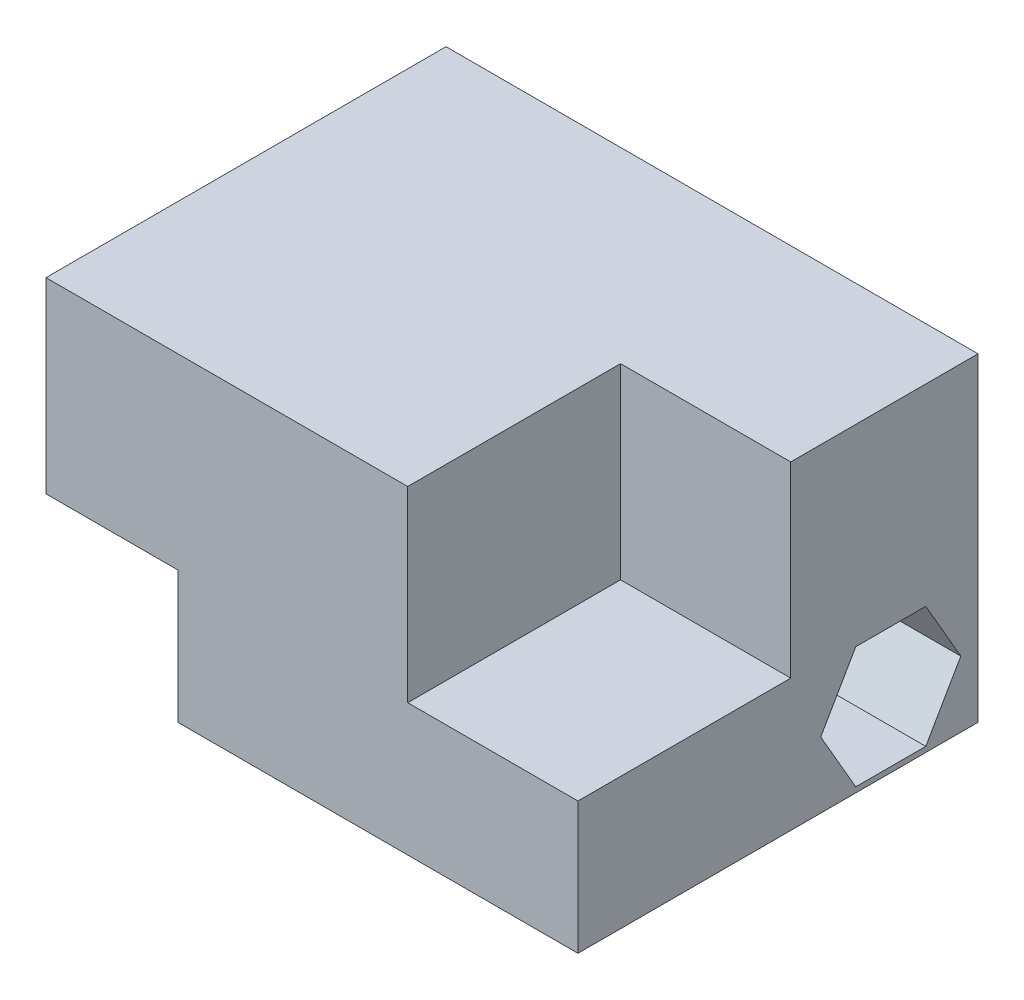
ISO-10303-21;
HEADER;
FILE_DESCRIPTION(('STEP AP214'),'2;1');
FILE_NAME('part.step','',(''),(''),'','','');
FILE_SCHEMA(('AUTOMOTIVE_DESIGN { 1 0 10303 214 1 1 1 1 }'));
ENDSEC;
DATA;
#1=APPLICATION_CONTEXT('core data for automotive mechanical design processes');
#2=APPLICATION_PROTOCOL_DEFINITION('international standard','automotive_design',2000,#1);
#3=PRODUCT_CONTEXT('',#1,'mechanical');
#4=PRODUCT('Part','Part','',(#3));
#5=PRODUCT_RELATED_PRODUCT_CATEGORY('part','',(#4));
#6=PRODUCT_DEFINITION_FORMATION('','',#4);
#7=PRODUCT_DEFINITION_CONTEXT('part definition',#1,'design');
#8=PRODUCT_DEFINITION('design','',#6,#7);
#9=PRODUCT_DEFINITION_SHAPE('','',#8);
#10=(LENGTH_UNIT() NAMED_UNIT(*) SI_UNIT(.MILLI.,.METRE.));
#11=(NAMED_UNIT(*) PLANE_ANGLE_UNIT() SI_UNIT($,.RADIAN.));
#12=(NAMED_UNIT(*) SI_UNIT($,.STERADIAN.) SOLID_ANGLE_UNIT());
#13=UNCERTAINTY_MEASURE_WITH_UNIT(LENGTH_MEASURE(1.E-05),#10,'distance_accuracy_value','');
#14=(GEOMETRIC_REPRESENTATION_CONTEXT(3) GLOBAL_UNCERTAINTY_ASSIGNED_CONTEXT((#13)) GLOBAL_UNIT_ASSIGNED_CONTEXT((#10,
#11,#12)) REPRESENTATION_CONTEXT('',''));
#15=CARTESIAN_POINT('',(0.,0.,0.));
#16=DIRECTION('',(0.,0.,1.));
#17=DIRECTION('',(1.,0.,0.));
#18=AXIS2_PLACEMENT_3D('',#15,#16,#17);
#19=CARTESIAN_POINT('',(-25.001,3.1,4.1));
#20=DIRECTION('',(1.,0.,0.));
#21=DIRECTION('',(0.,0.,-1.));
#22=AXIS2_PLACEMENT_3D('',#19,#20,#21);
#23=CYLINDRICAL_SURFACE('',#22,1.6);
#24=CARTESIAN_POINT('',(-18.8,3.1,4.1));
#25=DIRECTION('',(1.,0.,0.));
#26=DIRECTION('',(0.,0.,-1.));
#27=AXIS2_PLACEMENT_3D('',#24,#25,#26);
#28=CIRCLE('',#27,1.6);
#29=CARTESIAN_POINT('',(-18.8,3.1,2.5));
#30=VERTEX_POINT('',#29);
#31=EDGE_CURVE('E188',#30,#30,#28,.F.);
#32=ORIENTED_EDGE('',*,*,#31,.T.);
#33=EDGE_LOOP('',(#32));
#34=FACE_BOUND('',#33,.T.);
#35=CARTESIAN_POINT('',(-11.8,3.1,4.1));
#36=DIRECTION('',(1.,0.,0.));
#37=DIRECTION('',(0.,0.,-1.));
#38=AXIS2_PLACEMENT_3D('',#35,#36,#37);
#39=CIRCLE('',#38,1.6);
#40=CARTESIAN_POINT('',(-11.8,3.1,2.5));
#41=VERTEX_POINT('',#40);
#42=EDGE_CURVE('E37',#41,#41,#39,.F.);
#43=ORIENTED_EDGE('',*,*,#42,.F.);
#44=EDGE_LOOP('',(#43));
#45=FACE_BOUND('',#44,.T.);
#46=ADVANCED_FACE('F33',(#34,#45),#23,.F.);
#47=CARTESIAN_POINT('',(-18.8,0.,8.8));
#48=DIRECTION('',(0.,1.,0.));
#49=DIRECTION('',(0.,0.,1.));
#50=AXIS2_PLACEMENT_3D('',#47,#48,#49);
#51=PLANE('',#50);
#52=DIRECTION('',(1.,0.,0.));
#53=VECTOR('',#52,1.);
#54=CARTESIAN_POINT('',(-18.8,0.,0.));
#55=LINE('',#54,#53);
#56=CARTESIAN_POINT('',(-18.8,0.,0.));
#57=VERTEX_POINT('',#56);
#58=CARTESIAN_POINT('',(0.,0.,0.));
#59=VERTEX_POINT('',#58);
#60=EDGE_CURVE('E235',#57,#59,#55,.T.);
#61=ORIENTED_EDGE('',*,*,#60,.T.);
#62=DIRECTION('',(0.,0.,-1.));
#63=VECTOR('',#62,1.);
#64=CARTESIAN_POINT('',(0.,0.,8.8));
#65=LINE('',#64,#63);
#66=CARTESIAN_POINT('',(0.,0.,18.8));
#67=VERTEX_POINT('',#66);
#68=EDGE_CURVE('E12',#67,#59,#65,.T.);
#69=ORIENTED_EDGE('',*,*,#68,.F.);
#70=DIRECTION('',(1.,0.,0.));
#71=VECTOR('',#70,1.);
#72=CARTESIAN_POINT('',(-18.8,0.,18.8));
#73=LINE('',#72,#71);
#74=CARTESIAN_POINT('',(-18.8,0.,18.8));
#75=VERTEX_POINT('',#74);
#76=EDGE_CURVE('E195',#75,#67,#73,.T.);
#77=ORIENTED_EDGE('',*,*,#76,.F.);
#78=DIRECTION('',(0.,0.,-1.));
#79=VECTOR('',#78,1.);
#80=CARTESIAN_POINT('',(-18.8,0.,8.8));
#81=LINE('',#80,#79);
#82=EDGE_CURVE('E249',#75,#57,#81,.T.);
#83=ORIENTED_EDGE('',*,*,#82,.T.);
#84=EDGE_LOOP('',(#61,#69,#77,#83));
#85=FACE_BOUND('',#84,.T.);
#86=ADVANCED_FACE('F35',(#85),#51,.F.);
#87=CARTESIAN_POINT('',(0.,0.,8.8));
#88=DIRECTION('',(-1.,0.,0.));
#89=DIRECTION('',(0.,0.,1.));
#90=AXIS2_PLACEMENT_3D('',#87,#88,#89);
#91=PLANE('',#90);
#92=DIRECTION('',(0.,0.866025403784439,0.5));
#93=VECTOR('',#92,1.);
#94=CARTESIAN_POINT('',(0.,3.1,0.809103465619132));
#95=LINE('',#94,#93);
#96=CARTESIAN_POINT('',(0.,3.1,0.809103465619131));
#97=VERTEX_POINT('',#96);
#98=CARTESIAN_POINT('',(0.,5.95,2.45455173280956));
#99=VERTEX_POINT('',#98);
#100=EDGE_CURVE('E158',#97,#99,#95,.T.);
#101=ORIENTED_EDGE('',*,*,#100,.F.);
#102=DIRECTION('',(0.,0.866025403784439,-0.5));
#103=VECTOR('',#102,1.);
#104=CARTESIAN_POINT('',(0.,0.249999999999999,2.45455173280957));
#105=LINE('',#104,#103);
#106=CARTESIAN_POINT('',(0.,0.249999999999999,2.45455173280957));
#107=VERTEX_POINT('',#106);
#108=EDGE_CURVE('E50',#107,#97,#105,.T.);
#109=ORIENTED_EDGE('',*,*,#108,.F.);
#110=DIRECTION('',(0.,0.,-1.));
#111=VECTOR('',#110,1.);
#112=CARTESIAN_POINT('',(0.,0.249999999999999,5.74544826719043));
#113=LINE('',#112,#111);
#114=CARTESIAN_POINT('',(0.,0.249999999999999,5.74544826719043));
#115=VERTEX_POINT('',#114);
#116=EDGE_CURVE('E174',#115,#107,#113,.T.);
#117=ORIENTED_EDGE('',*,*,#116,.F.);
#118=DIRECTION('',(0.,-0.866025403784439,-0.5));
#119=VECTOR('',#118,1.);
#120=CARTESIAN_POINT('',(0.,3.1,7.39089653438086));
#121=LINE('',#120,#119);
#122=CARTESIAN_POINT('',(0.,3.1,7.39089653438086));
#123=VERTEX_POINT('',#122);
#124=EDGE_CURVE('E168',#123,#115,#121,.T.);
#125=ORIENTED_EDGE('',*,*,#124,.F.);
#126=DIRECTION('',(0.,-0.866025403784439,0.5));
#127=VECTOR('',#126,1.);
#128=CARTESIAN_POINT('',(0.,5.95,5.74544826719043));
#129=LINE('',#128,#127);
#130=CARTESIAN_POINT('',(0.,5.95,5.74544826719043));
#131=VERTEX_POINT('',#130);
#132=EDGE_CURVE('E166',#131,#123,#129,.T.);
#133=ORIENTED_EDGE('',*,*,#132,.F.);
#134=DIRECTION('',(0.,0.,1.));
#135=VECTOR('',#134,1.);
#136=CARTESIAN_POINT('',(0.,5.95,2.45455173280956));
#137=LINE('',#136,#135);
#138=EDGE_CURVE('E148',#99,#131,#137,.T.);
#139=ORIENTED_EDGE('',*,*,#138,.F.);
#140=EDGE_LOOP('',(#101,#109,#117,#125,#133,#139));
#141=FACE_BOUND('',#140,.T.);
#142=DIRECTION('',(0.,1.,0.));
#143=VECTOR('',#142,1.);
#144=CARTESIAN_POINT('',(0.,0.,0.));
#145=LINE('',#144,#143);
#146=CARTESIAN_POINT('',(0.,15.,0.));
#147=VERTEX_POINT('',#146);
#148=EDGE_CURVE('E241',#59,#147,#145,.T.);
#149=ORIENTED_EDGE('',*,*,#148,.T.);
#150=DIRECTION('',(0.,0.,-1.));
#151=VECTOR('',#150,1.);
#152=CARTESIAN_POINT('',(0.,15.,8.8));
#153=LINE('',#152,#151);
#154=CARTESIAN_POINT('',(0.,15.,8.8));
#155=VERTEX_POINT('',#154);
#156=EDGE_CURVE('E42',#155,#147,#153,.T.);
#157=ORIENTED_EDGE('',*,*,#156,.F.);
#158=DIRECTION('',(0.,1.,0.));
#159=VECTOR('',#158,1.);
#160=CARTESIAN_POINT('',(0.,0.,8.8));
#161=LINE('',#160,#159);
#162=CARTESIAN_POINT('',(0.,6.2,8.8));
#163=VERTEX_POINT('',#162);
#164=EDGE_CURVE('E250',#163,#155,#161,.T.);
#165=ORIENTED_EDGE('',*,*,#164,.F.);
#166=DIRECTION('',(0.,0.,-1.));
#167=VECTOR('',#166,1.);
#168=CARTESIAN_POINT('',(0.,6.2,18.8));
#169=LINE('',#168,#167);
#170=CARTESIAN_POINT('',(0.,6.2,18.8));
#171=VERTEX_POINT('',#170);
#172=EDGE_CURVE('E230',#171,#163,#169,.T.);
#173=ORIENTED_EDGE('',*,*,#172,.F.);
#174=DIRECTION('',(0.,1.,0.));
#175=VECTOR('',#174,1.);
#176=CARTESIAN_POINT('',(0.,6.2,18.8));
#177=LINE('',#176,#175);
#178=EDGE_CURVE('E199',#67,#171,#177,.T.);
#179=ORIENTED_EDGE('',*,*,#178,.F.);
#180=ORIENTED_EDGE('',*,*,#68,.T.);
#181=EDGE_LOOP('',(#149,#157,#165,#173,#179,#180));
#182=FACE_BOUND('',#181,.T.);
#183=ADVANCED_FACE('F162',(#141,#182),#91,.F.);
#184=CARTESIAN_POINT('',(0.,15.,8.8));
#185=DIRECTION('',(0.,-1.,0.));
#186=DIRECTION('',(1.,0.,0.));
#187=AXIS2_PLACEMENT_3D('',#184,#185,#186);
#188=PLANE('',#187);
#189=DIRECTION('',(-1.,0.,0.));
#190=VECTOR('',#189,1.);
#191=CARTESIAN_POINT('',(0.,15.,0.));
#192=LINE('',#191,#190);
#193=CARTESIAN_POINT('',(-25.,15.,0.));
#194=VERTEX_POINT('',#193);
#195=EDGE_CURVE('E255',#147,#194,#192,.T.);
#196=ORIENTED_EDGE('',*,*,#195,.T.);
#197=DIRECTION('',(0.,0.,-1.));
#198=VECTOR('',#197,1.);
#199=CARTESIAN_POINT('',(-25.,15.,8.8));
#200=LINE('',#199,#198);
#201=CARTESIAN_POINT('',(-25.,15.,18.8));
#202=VERTEX_POINT('',#201);
#203=EDGE_CURVE('E271',#202,#194,#200,.T.);
#204=ORIENTED_EDGE('',*,*,#203,.F.);
#205=DIRECTION('',(-1.,0.,0.));
#206=VECTOR('',#205,1.);
#207=CARTESIAN_POINT('',(-8.,15.,18.8));
#208=LINE('',#207,#206);
#209=CARTESIAN_POINT('',(-8.,15.,18.8));
#210=VERTEX_POINT('',#209);
#211=EDGE_CURVE('E205',#210,#202,#208,.T.);
#212=ORIENTED_EDGE('',*,*,#211,.F.);
#213=DIRECTION('',(0.,0.,-1.));
#214=VECTOR('',#213,1.);
#215=CARTESIAN_POINT('',(-8.,15.,18.8));
#216=LINE('',#215,#214);
#217=CARTESIAN_POINT('',(-8.,15.,8.8));
#218=VERTEX_POINT('',#217);
#219=EDGE_CURVE('E214',#210,#218,#216,.T.);
#220=ORIENTED_EDGE('',*,*,#219,.T.);
#221=DIRECTION('',(-1.,0.,0.));
#222=VECTOR('',#221,1.);
#223=CARTESIAN_POINT('',(0.,15.,8.8));
#224=LINE('',#223,#222);
#225=EDGE_CURVE('E58',#155,#218,#224,.T.);
#226=ORIENTED_EDGE('',*,*,#225,.F.);
#227=ORIENTED_EDGE('',*,*,#156,.T.);
#228=EDGE_LOOP('',(#196,#204,#212,#220,#226,#227));
#229=FACE_BOUND('',#228,.T.);
#230=ADVANCED_FACE('F277',(#229),#188,.F.);
#231=CARTESIAN_POINT('',(-25.,15.,8.8));
#232=DIRECTION('',(1.,0.,0.));
#233=DIRECTION('',(0.,1.,0.));
#234=AXIS2_PLACEMENT_3D('',#231,#232,#233);
#235=PLANE('',#234);
#236=DIRECTION('',(0.,-1.,0.));
#237=VECTOR('',#236,1.);
#238=CARTESIAN_POINT('',(-25.,15.,0.));
#239=LINE('',#238,#237);
#240=CARTESIAN_POINT('',(-25.,6.2,0.));
#241=VERTEX_POINT('',#240);
#242=EDGE_CURVE('E257',#194,#241,#239,.T.);
#243=ORIENTED_EDGE('',*,*,#242,.T.);
#244=DIRECTION('',(0.,0.,-1.));
#245=VECTOR('',#244,1.);
#246=CARTESIAN_POINT('',(-25.,6.2,8.8));
#247=LINE('',#246,#245);
#248=CARTESIAN_POINT('',(-25.,6.2,18.8));
#249=VERTEX_POINT('',#248);
#250=EDGE_CURVE('E268',#249,#241,#247,.T.);
#251=ORIENTED_EDGE('',*,*,#250,.F.);
#252=DIRECTION('',(0.,-1.,0.));
#253=VECTOR('',#252,1.);
#254=CARTESIAN_POINT('',(-25.,15.,18.8));
#255=LINE('',#254,#253);
#256=EDGE_CURVE('E208',#202,#249,#255,.T.);
#257=ORIENTED_EDGE('',*,*,#256,.F.);
#258=ORIENTED_EDGE('',*,*,#203,.T.);
#259=EDGE_LOOP('',(#243,#251,#257,#258));
#260=FACE_BOUND('',#259,.T.);
#261=ADVANCED_FACE('F286',(#260),#235,.F.);
#262=CARTESIAN_POINT('',(-25.,6.2,8.8));
#263=DIRECTION('',(0.,1.,0.));
#264=DIRECTION('',(0.,0.,1.));
#265=AXIS2_PLACEMENT_3D('',#262,#263,#264);
#266=PLANE('',#265);
#267=DIRECTION('',(1.,0.,0.));
#268=VECTOR('',#267,1.);
#269=CARTESIAN_POINT('',(-25.,6.2,0.));
#270=LINE('',#269,#268);
#271=CARTESIAN_POINT('',(-18.8,6.2,0.));
#272=VERTEX_POINT('',#271);
#273=EDGE_CURVE('E259',#241,#272,#270,.T.);
#274=ORIENTED_EDGE('',*,*,#273,.T.);
#275=DIRECTION('',(0.,0.,-1.));
#276=VECTOR('',#275,1.);
#277=CARTESIAN_POINT('',(-18.8,6.2,8.8));
#278=LINE('',#277,#276);
#279=CARTESIAN_POINT('',(-18.8,6.2,18.8));
#280=VERTEX_POINT('',#279);
#281=EDGE_CURVE('E265',#280,#272,#278,.T.);
#282=ORIENTED_EDGE('',*,*,#281,.F.);
#283=DIRECTION('',(1.,0.,0.));
#284=VECTOR('',#283,1.);
#285=CARTESIAN_POINT('',(-25.,6.2,18.8));
#286=LINE('',#285,#284);
#287=EDGE_CURVE('E211',#249,#280,#286,.T.);
#288=ORIENTED_EDGE('',*,*,#287,.F.);
#289=ORIENTED_EDGE('',*,*,#250,.T.);
#290=EDGE_LOOP('',(#274,#282,#288,#289));
#291=FACE_BOUND('',#290,.T.);
#292=ADVANCED_FACE('F290',(#291),#266,.F.);
#293=CARTESIAN_POINT('',(-18.8,6.2,8.8));
#294=DIRECTION('',(1.,0.,0.));
#295=DIRECTION('',(0.,0.,-1.));
#296=AXIS2_PLACEMENT_3D('',#293,#294,#295);
#297=PLANE('',#296);
#298=ORIENTED_EDGE('',*,*,#31,.F.);
#299=EDGE_LOOP('',(#298));
#300=FACE_BOUND('',#299,.T.);
#301=DIRECTION('',(0.,-1.,0.));
#302=VECTOR('',#301,1.);
#303=CARTESIAN_POINT('',(-18.8,6.2,0.));
#304=LINE('',#303,#302);
#305=EDGE_CURVE('E261',#272,#57,#304,.T.);
#306=ORIENTED_EDGE('',*,*,#305,.T.);
#307=ORIENTED_EDGE('',*,*,#82,.F.);
#308=DIRECTION('',(0.,-1.,0.));
#309=VECTOR('',#308,1.);
#310=CARTESIAN_POINT('',(-18.8,6.2,18.8));
#311=LINE('',#310,#309);
#312=EDGE_CURVE('E192',#280,#75,#311,.T.);
#313=ORIENTED_EDGE('',*,*,#312,.F.);
#314=ORIENTED_EDGE('',*,*,#281,.T.);
#315=EDGE_LOOP('',(#306,#307,#313,#314));
#316=FACE_BOUND('',#315,.T.);
#317=ADVANCED_FACE('F295',(#300,#316),#297,.F.);
#318=CARTESIAN_POINT('',(0.,0.,8.8));
#319=DIRECTION('',(0.,0.,1.));
#320=DIRECTION('',(1.,0.,0.));
#321=AXIS2_PLACEMENT_3D('',#318,#319,#320);
#322=PLANE('',#321);
#323=DIRECTION('',(0.,1.,0.));
#324=VECTOR('',#323,1.);
#325=CARTESIAN_POINT('',(-8.,15.,8.8));
#326=LINE('',#325,#324);
#327=CARTESIAN_POINT('',(-7.99999999999999,6.2,8.8));
#328=VERTEX_POINT('',#327);
#329=EDGE_CURVE('E196',#328,#218,#326,.T.);
#330=ORIENTED_EDGE('',*,*,#329,.F.);
#331=DIRECTION('',(-1.,0.,0.));
#332=VECTOR('',#331,1.);
#333=CARTESIAN_POINT('',(-7.99999999999999,6.2,8.8));
#334=LINE('',#333,#332);
#335=EDGE_CURVE('E191',#163,#328,#334,.T.);
#336=ORIENTED_EDGE('',*,*,#335,.F.);
#337=ORIENTED_EDGE('',*,*,#164,.T.);
#338=ORIENTED_EDGE('',*,*,#225,.T.);
#339=EDGE_LOOP('',(#330,#336,#337,#338));
#340=FACE_BOUND('',#339,.T.);
#341=ADVANCED_FACE('F301',(#340),#322,.T.);
#342=CARTESIAN_POINT('',(0.,0.,0.));
#343=DIRECTION('',(0.,0.,1.));
#344=DIRECTION('',(1.,0.,0.));
#345=AXIS2_PLACEMENT_3D('',#342,#343,#344);
#346=PLANE('',#345);
#347=ORIENTED_EDGE('',*,*,#60,.F.);
#348=ORIENTED_EDGE('',*,*,#305,.F.);
#349=ORIENTED_EDGE('',*,*,#273,.F.);
#350=ORIENTED_EDGE('',*,*,#242,.F.);
#351=ORIENTED_EDGE('',*,*,#195,.F.);
#352=ORIENTED_EDGE('',*,*,#148,.F.);
#353=EDGE_LOOP('',(#347,#348,#349,#350,#351,#352));
#354=FACE_BOUND('',#353,.T.);
#355=ADVANCED_FACE('F282',(#354),#346,.F.);
#356=CARTESIAN_POINT('',(-7.99999999999999,6.2,18.8));
#357=DIRECTION('',(0.,-1.,0.));
#358=DIRECTION('',(0.,0.,-1.));
#359=AXIS2_PLACEMENT_3D('',#356,#357,#358);
#360=PLANE('',#359);
#361=ORIENTED_EDGE('',*,*,#335,.T.);
#362=DIRECTION('',(0.,0.,-1.));
#363=VECTOR('',#362,1.);
#364=CARTESIAN_POINT('',(-7.99999999999999,6.2,18.8));
#365=LINE('',#364,#363);
#366=CARTESIAN_POINT('',(-7.99999999999999,6.2,18.8));
#367=VERTEX_POINT('',#366);
#368=EDGE_CURVE('E217',#367,#328,#365,.T.);
#369=ORIENTED_EDGE('',*,*,#368,.F.);
#370=DIRECTION('',(-1.,0.,0.));
#371=VECTOR('',#370,1.);
#372=CARTESIAN_POINT('',(-7.99999999999999,6.2,18.8));
#373=LINE('',#372,#371);
#374=EDGE_CURVE('E201',#171,#367,#373,.T.);
#375=ORIENTED_EDGE('',*,*,#374,.F.);
#376=ORIENTED_EDGE('',*,*,#172,.T.);
#377=EDGE_LOOP('',(#361,#369,#375,#376));
#378=FACE_BOUND('',#377,.T.);
#379=ADVANCED_FACE('F299',(#378),#360,.F.);
#380=CARTESIAN_POINT('',(-8.,15.,18.8));
#381=DIRECTION('',(-1.,0.,0.));
#382=DIRECTION('',(0.,-1.,0.));
#383=AXIS2_PLACEMENT_3D('',#380,#381,#382);
#384=PLANE('',#383);
#385=ORIENTED_EDGE('',*,*,#329,.T.);
#386=ORIENTED_EDGE('',*,*,#219,.F.);
#387=DIRECTION('',(0.,1.,0.));
#388=VECTOR('',#387,1.);
#389=CARTESIAN_POINT('',(-8.,15.,18.8));
#390=LINE('',#389,#388);
#391=EDGE_CURVE('E203',#367,#210,#390,.T.);
#392=ORIENTED_EDGE('',*,*,#391,.F.);
#393=ORIENTED_EDGE('',*,*,#368,.T.);
#394=EDGE_LOOP('',(#385,#386,#392,#393));
#395=FACE_BOUND('',#394,.T.);
#396=ADVANCED_FACE('F300',(#395),#384,.F.);
#397=CARTESIAN_POINT('',(-18.8,0.,18.8));
#398=DIRECTION('',(0.,0.,1.));
#399=DIRECTION('',(1.,0.,0.));
#400=AXIS2_PLACEMENT_3D('',#397,#398,#399);
#401=PLANE('',#400);
#402=ORIENTED_EDGE('',*,*,#312,.T.);
#403=ORIENTED_EDGE('',*,*,#76,.T.);
#404=ORIENTED_EDGE('',*,*,#178,.T.);
#405=ORIENTED_EDGE('',*,*,#374,.T.);
#406=ORIENTED_EDGE('',*,*,#391,.T.);
#407=ORIENTED_EDGE('',*,*,#211,.T.);
#408=ORIENTED_EDGE('',*,*,#256,.T.);
#409=ORIENTED_EDGE('',*,*,#287,.T.);
#410=EDGE_LOOP('',(#402,#403,#404,#405,#406,#407,#408,#409));
#411=FACE_BOUND('',#410,.T.);
#412=ADVANCED_FACE('F293',(#411),#401,.T.);
#413=CARTESIAN_POINT('',(-11.8,6.2,8.8));
#414=DIRECTION('',(1.,0.,0.));
#415=DIRECTION('',(0.,0.,-1.));
#416=AXIS2_PLACEMENT_3D('',#413,#414,#415);
#417=PLANE('',#416);
#418=DIRECTION('',(0.,-0.866025403784439,0.5));
#419=VECTOR('',#418,1.);
#420=CARTESIAN_POINT('',(-11.8,0.249999999999999,2.45455173280957));
#421=LINE('',#420,#419);
#422=CARTESIAN_POINT('',(-11.8,3.1,0.809103465619132));
#423=VERTEX_POINT('',#422);
#424=CARTESIAN_POINT('',(-11.8,0.249999999999999,2.45455173280957));
#425=VERTEX_POINT('',#424);
#426=EDGE_CURVE('E187',#423,#425,#421,.T.);
#427=ORIENTED_EDGE('',*,*,#426,.F.);
#428=DIRECTION('',(0.,-0.866025403784439,-0.5));
#429=VECTOR('',#428,1.);
#430=CARTESIAN_POINT('',(-11.8,3.1,0.809103465619132));
#431=LINE('',#430,#429);
#432=CARTESIAN_POINT('',(-11.8,5.95,2.45455173280956));
#433=VERTEX_POINT('',#432);
#434=EDGE_CURVE('E185',#433,#423,#431,.T.);
#435=ORIENTED_EDGE('',*,*,#434,.F.);
#436=DIRECTION('',(0.,0.,-1.));
#437=VECTOR('',#436,1.);
#438=CARTESIAN_POINT('',(-11.8,5.95,2.45455173280956));
#439=LINE('',#438,#437);
#440=CARTESIAN_POINT('',(-11.8,5.95,5.74544826719043));
#441=VERTEX_POINT('',#440);
#442=EDGE_CURVE('E151',#441,#433,#439,.T.);
#443=ORIENTED_EDGE('',*,*,#442,.F.);
#444=DIRECTION('',(0.,0.866025403784439,-0.5));
#445=VECTOR('',#444,1.);
#446=CARTESIAN_POINT('',(-11.8,5.95,5.74544826719043));
#447=LINE('',#446,#445);
#448=CARTESIAN_POINT('',(-11.8,3.1,7.39089653438086));
#449=VERTEX_POINT('',#448);
#450=EDGE_CURVE('E487',#449,#441,#447,.T.);
#451=ORIENTED_EDGE('',*,*,#450,.F.);
#452=DIRECTION('',(0.,0.866025403784439,0.5));
#453=VECTOR('',#452,1.);
#454=CARTESIAN_POINT('',(-11.8,3.1,7.39089653438086));
#455=LINE('',#454,#453);
#456=CARTESIAN_POINT('',(-11.8,0.249999999999999,5.74544826719043));
#457=VERTEX_POINT('',#456);
#458=EDGE_CURVE('E489',#457,#449,#455,.T.);
#459=ORIENTED_EDGE('',*,*,#458,.F.);
#460=DIRECTION('',(0.,0.,1.));
#461=VECTOR('',#460,1.);
#462=CARTESIAN_POINT('',(-11.8,0.249999999999999,5.74544826719043));
#463=LINE('',#462,#461);
#464=EDGE_CURVE('E496',#425,#457,#463,.T.);
#465=ORIENTED_EDGE('',*,*,#464,.F.);
#466=EDGE_LOOP('',(#427,#435,#443,#451,#459,#465));
#467=FACE_BOUND('',#466,.T.);
#468=ORIENTED_EDGE('',*,*,#42,.T.);
#469=EDGE_LOOP('',(#468));
#470=FACE_BOUND('',#469,.T.);
#471=ADVANCED_FACE('F325',(#467,#470),#417,.T.);
#472=CARTESIAN_POINT('',(-27.5068938204161,0.249999999999999,2.45455173280957));
#473=DIRECTION('',(0.,-0.5,-0.866025403784439));
#474=DIRECTION('',(0.,0.866025403784439,-0.5));
#475=AXIS2_PLACEMENT_3D('',#472,#473,#474);
#476=PLANE('',#475);
#477=ORIENTED_EDGE('',*,*,#426,.T.);
#478=DIRECTION('',(1.,0.,0.));
#479=VECTOR('',#478,1.);
#480=CARTESIAN_POINT('',(-27.5068938204161,0.249999999999999,2.45455173280957));
#481=LINE('',#480,#479);
#482=EDGE_CURVE('E177',#425,#107,#481,.T.);
#483=ORIENTED_EDGE('',*,*,#482,.T.);
#484=ORIENTED_EDGE('',*,*,#108,.T.);
#485=DIRECTION('',(1.,0.,0.));
#486=VECTOR('',#485,1.);
#487=CARTESIAN_POINT('',(-27.5068938204161,3.1,0.809103465619132));
#488=LINE('',#487,#486);
#489=EDGE_CURVE('E155',#423,#97,#488,.T.);
#490=ORIENTED_EDGE('',*,*,#489,.F.);
#491=EDGE_LOOP('',(#477,#483,#484,#490));
#492=FACE_BOUND('',#491,.T.);
#493=ADVANCED_FACE('F321',(#492),#476,.F.);
#494=CARTESIAN_POINT('',(-27.5068938204161,0.249999999999999,5.74544826719043));
#495=DIRECTION('',(0.,-1.,0.));
#496=DIRECTION('',(0.,0.,-1.));
#497=AXIS2_PLACEMENT_3D('',#494,#495,#496);
#498=PLANE('',#497);
#499=ORIENTED_EDGE('',*,*,#464,.T.);
#500=DIRECTION('',(1.,0.,0.));
#501=VECTOR('',#500,1.);
#502=CARTESIAN_POINT('',(-27.5068938204161,0.249999999999999,5.74544826719043));
#503=LINE('',#502,#501);
#504=EDGE_CURVE('E179',#457,#115,#503,.T.);
#505=ORIENTED_EDGE('',*,*,#504,.T.);
#506=ORIENTED_EDGE('',*,*,#116,.T.);
#507=ORIENTED_EDGE('',*,*,#482,.F.);
#508=EDGE_LOOP('',(#499,#505,#506,#507));
#509=FACE_BOUND('',#508,.T.);
#510=ADVANCED_FACE('F355',(#509),#498,.F.);
#511=CARTESIAN_POINT('',(-27.5068938204161,3.1,7.39089653438086));
#512=DIRECTION('',(0.,-0.5,0.866025403784438));
#513=DIRECTION('',(0.,-0.866025403784439,-0.5));
#514=AXIS2_PLACEMENT_3D('',#511,#512,#513);
#515=PLANE('',#514);
#516=ORIENTED_EDGE('',*,*,#458,.T.);
#517=DIRECTION('',(1.,0.,0.));
#518=VECTOR('',#517,1.);
#519=CARTESIAN_POINT('',(-27.5068938204161,3.1,7.39089653438086));
#520=LINE('',#519,#518);
#521=EDGE_CURVE('E181',#449,#123,#520,.T.);
#522=ORIENTED_EDGE('',*,*,#521,.T.);
#523=ORIENTED_EDGE('',*,*,#124,.T.);
#524=ORIENTED_EDGE('',*,*,#504,.F.);
#525=EDGE_LOOP('',(#516,#522,#523,#524));
#526=FACE_BOUND('',#525,.T.);
#527=ADVANCED_FACE('F361',(#526),#515,.F.);
#528=CARTESIAN_POINT('',(-27.5068938204161,5.95,5.74544826719043));
#529=DIRECTION('',(0.,0.5,0.866025403784439));
#530=DIRECTION('',(0.,-0.866025403784439,0.5));
#531=AXIS2_PLACEMENT_3D('',#528,#529,#530);
#532=PLANE('',#531);
#533=ORIENTED_EDGE('',*,*,#450,.T.);
#534=DIRECTION('',(1.,0.,0.));
#535=VECTOR('',#534,1.);
#536=CARTESIAN_POINT('',(-27.5068938204161,5.95,5.74544826719043));
#537=LINE('',#536,#535);
#538=EDGE_CURVE('E154',#441,#131,#537,.T.);
#539=ORIENTED_EDGE('',*,*,#538,.T.);
#540=ORIENTED_EDGE('',*,*,#132,.T.);
#541=ORIENTED_EDGE('',*,*,#521,.F.);
#542=EDGE_LOOP('',(#533,#539,#540,#541));
#543=FACE_BOUND('',#542,.T.);
#544=ADVANCED_FACE('F369',(#543),#532,.F.);
#545=CARTESIAN_POINT('',(-27.5068938204161,5.95,2.45455173280956));
#546=DIRECTION('',(0.,1.,0.));
#547=DIRECTION('',(0.,0.,1.));
#548=AXIS2_PLACEMENT_3D('',#545,#546,#547);
#549=PLANE('',#548);
#550=ORIENTED_EDGE('',*,*,#442,.T.);
#551=DIRECTION('',(1.,0.,0.));
#552=VECTOR('',#551,1.);
#553=CARTESIAN_POINT('',(-27.5068938204161,5.95,2.45455173280956));
#554=LINE('',#553,#552);
#555=EDGE_CURVE('E143',#433,#99,#554,.T.);
#556=ORIENTED_EDGE('',*,*,#555,.T.);
#557=ORIENTED_EDGE('',*,*,#138,.T.);
#558=ORIENTED_EDGE('',*,*,#538,.F.);
#559=EDGE_LOOP('',(#550,#556,#557,#558));
#560=FACE_BOUND('',#559,.T.);
#561=ADVANCED_FACE('F145',(#560),#549,.F.);
#562=CARTESIAN_POINT('',(-27.5068938204161,3.1,0.809103465619132));
#563=DIRECTION('',(0.,0.5,-0.866025403784438));
#564=DIRECTION('',(0.,0.866025403784439,0.5));
#565=AXIS2_PLACEMENT_3D('',#562,#563,#564);
#566=PLANE('',#565);
#567=ORIENTED_EDGE('',*,*,#434,.T.);
#568=ORIENTED_EDGE('',*,*,#489,.T.);
#569=ORIENTED_EDGE('',*,*,#100,.T.);
#570=ORIENTED_EDGE('',*,*,#555,.F.);
#571=EDGE_LOOP('',(#567,#568,#569,#570));
#572=FACE_BOUND('',#571,.T.);
#573=ADVANCED_FACE('F159',(#572),#566,.F.);
#574=CLOSED_SHELL('',(#46,#86,#183,#230,#261,#292,#317,#341,#355,#379,#396,#412,#471,#493,#510,
#527,#544,#561,#573));
#575=MANIFOLD_SOLID_BREP('B2',#574);
#576=ADVANCED_BREP_SHAPE_REPRESENTATION('',(#18,#575),#14);
#577=SHAPE_DEFINITION_REPRESENTATION(#9,#576);
ENDSEC;
END-ISO-10303-21;
